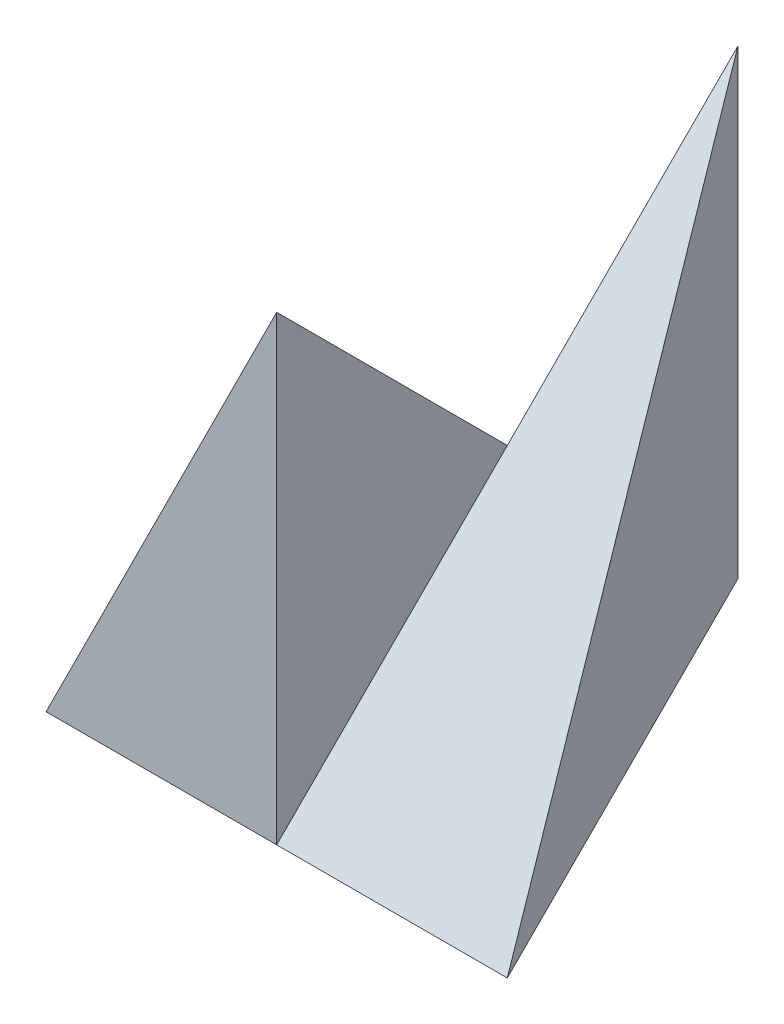
ISO-10303-21;
HEADER;
FILE_DESCRIPTION(('STEP AP214'),'2;1');
FILE_NAME('part.step','',(''),(''),'','','');
FILE_SCHEMA(('AUTOMOTIVE_DESIGN { 1 0 10303 214 1 1 1 1 }'));
ENDSEC;
DATA;
#1=APPLICATION_CONTEXT('core data for automotive mechanical design processes');
#2=APPLICATION_PROTOCOL_DEFINITION('international standard','automotive_design',2000,#1);
#3=PRODUCT_CONTEXT('',#1,'mechanical');
#4=PRODUCT('Part','Part','',(#3));
#5=PRODUCT_RELATED_PRODUCT_CATEGORY('part','',(#4));
#6=PRODUCT_DEFINITION_FORMATION('','',#4);
#7=PRODUCT_DEFINITION_CONTEXT('part definition',#1,'design');
#8=PRODUCT_DEFINITION('design','',#6,#7);
#9=PRODUCT_DEFINITION_SHAPE('','',#8);
#10=(LENGTH_UNIT() NAMED_UNIT(*) SI_UNIT(.MILLI.,.METRE.));
#11=(NAMED_UNIT(*) PLANE_ANGLE_UNIT() SI_UNIT($,.RADIAN.));
#12=(NAMED_UNIT(*) SI_UNIT($,.STERADIAN.) SOLID_ANGLE_UNIT());
#13=UNCERTAINTY_MEASURE_WITH_UNIT(LENGTH_MEASURE(1.E-05),#10,'distance_accuracy_value','');
#14=(GEOMETRIC_REPRESENTATION_CONTEXT(3) GLOBAL_UNCERTAINTY_ASSIGNED_CONTEXT((#13)) GLOBAL_UNIT_ASSIGNED_CONTEXT((#10,
#11,#12)) REPRESENTATION_CONTEXT('',''));
#15=CARTESIAN_POINT('',(0.,0.,0.));
#16=DIRECTION('',(0.,0.,1.));
#17=DIRECTION('',(1.,0.,0.));
#18=AXIS2_PLACEMENT_3D('',#15,#16,#17);
#19=CARTESIAN_POINT('',(-2.,4.,2.));
#20=DIRECTION('',(0.,0.,-1.));
#21=DIRECTION('',(-1.,0.,0.));
#22=AXIS2_PLACEMENT_3D('',#19,#20,#21);
#23=PLANE('',#22);
#24=DIRECTION('',(0.,-1.,0.));
#25=VECTOR('',#24,1.);
#26=CARTESIAN_POINT('',(0.,4.,2.));
#27=LINE('',#26,#25);
#28=CARTESIAN_POINT('',(0.,4.,2.));
#29=VERTEX_POINT('',#28);
#30=CARTESIAN_POINT('',(0.,0.,2.));
#31=VERTEX_POINT('',#30);
#32=EDGE_CURVE('E149',#29,#31,#27,.T.);
#33=ORIENTED_EDGE('',*,*,#32,.F.);
#34=DIRECTION('',(0.447213595499958,0.894427190999916,0.));
#35=VECTOR('',#34,1.);
#36=CARTESIAN_POINT('',(-1.6,0.8,2.));
#37=LINE('',#36,#35);
#38=CARTESIAN_POINT('',(-2.,0.,2.));
#39=VERTEX_POINT('',#38);
#40=EDGE_CURVE('E151',#39,#29,#37,.T.);
#41=ORIENTED_EDGE('',*,*,#40,.F.);
#42=DIRECTION('',(1.,0.,0.));
#43=VECTOR('',#42,1.);
#44=CARTESIAN_POINT('',(-2.,0.,2.));
#45=LINE('',#44,#43);
#46=EDGE_CURVE('E78',#39,#31,#45,.T.);
#47=ORIENTED_EDGE('',*,*,#46,.T.);
#48=EDGE_LOOP('',(#33,#41,#47));
#49=FACE_BOUND('',#48,.T.);
#50=ADVANCED_FACE('F71',(#49),#23,.F.);
#51=CARTESIAN_POINT('',(0.,0.,0.));
#52=DIRECTION('',(0.,-1.,0.));
#53=DIRECTION('',(0.,0.,-1.));
#54=AXIS2_PLACEMENT_3D('',#51,#52,#53);
#55=PLANE('',#54);
#56=DIRECTION('',(-0.447213595499958,0.,0.894427190999916));
#57=VECTOR('',#56,1.);
#58=CARTESIAN_POINT('',(-0.800000000000001,0.,-0.4));
#59=LINE('',#58,#57);
#60=CARTESIAN_POINT('',(0.,0.,-2.));
#61=VERTEX_POINT('',#60);
#62=EDGE_CURVE('E112',#61,#39,#59,.T.);
#63=ORIENTED_EDGE('',*,*,#62,.F.);
#64=DIRECTION('',(-0.447213595499958,0.,-0.894427190999916));
#65=VECTOR('',#64,1.);
#66=CARTESIAN_POINT('',(0.799999999999999,0.,-0.4));
#67=LINE('',#66,#65);
#68=CARTESIAN_POINT('',(2.,0.,2.));
#69=VERTEX_POINT('',#68);
#70=EDGE_CURVE('E118',#69,#61,#67,.T.);
#71=ORIENTED_EDGE('',*,*,#70,.F.);
#72=DIRECTION('',(1.,0.,0.));
#73=VECTOR('',#72,1.);
#74=CARTESIAN_POINT('',(0.,0.,2.));
#75=LINE('',#74,#73);
#76=EDGE_CURVE('E140',#31,#69,#75,.T.);
#77=ORIENTED_EDGE('',*,*,#76,.F.);
#78=ORIENTED_EDGE('',*,*,#46,.F.);
#79=EDGE_LOOP('',(#63,#71,#77,#78));
#80=FACE_BOUND('',#79,.T.);
#81=ADVANCED_FACE('F123',(#80),#55,.T.);
#82=CARTESIAN_POINT('',(0.,4.,2.));
#83=DIRECTION('',(0.,-0.707106781186547,0.707106781186547));
#84=DIRECTION('',(0.,-0.707106781186548,-0.707106781186548));
#85=AXIS2_PLACEMENT_3D('',#82,#83,#84);
#86=PLANE('',#85);
#87=DIRECTION('',(0.,0.707106781186548,0.707106781186548));
#88=VECTOR('',#87,1.);
#89=CARTESIAN_POINT('',(0.,4.,2.));
#90=LINE('',#89,#88);
#91=CARTESIAN_POINT('',(0.,2.,0.));
#92=VERTEX_POINT('',#91);
#93=EDGE_CURVE('E133',#61,#92,#90,.T.);
#94=ORIENTED_EDGE('',*,*,#93,.F.);
#95=DIRECTION('',(-0.333333333333333,0.666666666666667,0.666666666666667));
#96=VECTOR('',#95,1.);
#97=CARTESIAN_POINT('',(-1.77777777777778,3.55555555555556,1.55555555555556));
#98=LINE('',#97,#96);
#99=CARTESIAN_POINT('',(-1.,2.,0.));
#100=VERTEX_POINT('',#99);
#101=EDGE_CURVE('E109',#61,#100,#98,.T.);
#102=ORIENTED_EDGE('',*,*,#101,.T.);
#103=DIRECTION('',(0.333333333333333,0.666666666666667,0.666666666666667));
#104=VECTOR('',#103,1.);
#105=CARTESIAN_POINT('',(0.,4.,2.));
#106=LINE('',#105,#104);
#107=EDGE_CURVE('E153',#100,#29,#106,.T.);
#108=ORIENTED_EDGE('',*,*,#107,.T.);
#109=EDGE_CURVE('E136',#92,#29,#90,.T.);
#110=ORIENTED_EDGE('',*,*,#109,.F.);
#111=EDGE_LOOP('',(#94,#102,#108,#110));
#112=FACE_BOUND('',#111,.T.);
#113=ADVANCED_FACE('F134',(#112),#86,.F.);
#114=CARTESIAN_POINT('',(0.,0.,0.));
#115=DIRECTION('',(-1.,0.,0.));
#116=DIRECTION('',(0.,0.,1.));
#117=AXIS2_PLACEMENT_3D('',#114,#115,#116);
#118=PLANE('',#117);
#119=DIRECTION('',(0.,-0.707106781186548,0.707106781186548));
#120=VECTOR('',#119,1.);
#121=CARTESIAN_POINT('',(0.,1.,1.));
#122=LINE('',#121,#120);
#123=CARTESIAN_POINT('',(0.,4.,-2.));
#124=VERTEX_POINT('',#123);
#125=EDGE_CURVE('E12',#124,#92,#122,.T.);
#126=ORIENTED_EDGE('',*,*,#125,.F.);
#127=DIRECTION('',(0.,-1.,0.));
#128=VECTOR('',#127,1.);
#129=CARTESIAN_POINT('',(0.,0.,-2.));
#130=LINE('',#129,#128);
#131=EDGE_CURVE('E85',#124,#61,#130,.T.);
#132=ORIENTED_EDGE('',*,*,#131,.T.);
#133=ORIENTED_EDGE('',*,*,#93,.T.);
#134=EDGE_LOOP('',(#126,#132,#133));
#135=FACE_BOUND('',#134,.T.);
#136=ADVANCED_FACE('F139',(#135),#118,.T.);
#137=CARTESIAN_POINT('',(0.,0.,0.));
#138=DIRECTION('',(-1.,0.,0.));
#139=DIRECTION('',(0.,0.,1.));
#140=AXIS2_PLACEMENT_3D('',#137,#138,#139);
#141=PLANE('',#140);
#142=ORIENTED_EDGE('',*,*,#32,.T.);
#143=DIRECTION('',(0.,0.707106781186548,-0.707106781186548));
#144=VECTOR('',#143,1.);
#145=CARTESIAN_POINT('',(0.,0.,2.));
#146=LINE('',#145,#144);
#147=EDGE_CURVE('E142',#31,#92,#146,.T.);
#148=ORIENTED_EDGE('',*,*,#147,.T.);
#149=ORIENTED_EDGE('',*,*,#109,.T.);
#150=EDGE_LOOP('',(#142,#148,#149));
#151=FACE_BOUND('',#150,.T.);
#152=ADVANCED_FACE('F159',(#151),#141,.F.);
#153=CARTESIAN_POINT('',(0.,0.,2.));
#154=DIRECTION('',(0.,-0.707106781186547,-0.707106781186547));
#155=DIRECTION('',(0.,0.707106781186548,-0.707106781186548));
#156=AXIS2_PLACEMENT_3D('',#153,#154,#155);
#157=PLANE('',#156);
#158=ORIENTED_EDGE('',*,*,#76,.T.);
#159=DIRECTION('',(-0.333333333333333,0.666666666666667,-0.666666666666667));
#160=VECTOR('',#159,1.);
#161=CARTESIAN_POINT('',(1.77777777777778,0.444444444444444,1.55555555555556));
#162=LINE('',#161,#160);
#163=EDGE_CURVE('E129',#69,#124,#162,.T.);
#164=ORIENTED_EDGE('',*,*,#163,.T.);
#165=ORIENTED_EDGE('',*,*,#125,.T.);
#166=ORIENTED_EDGE('',*,*,#147,.F.);
#167=EDGE_LOOP('',(#158,#164,#165,#166));
#168=FACE_BOUND('',#167,.T.);
#169=ADVANCED_FACE('F160',(#168),#157,.F.);
#170=CARTESIAN_POINT('',(-1.6,0.8,-8.));
#171=DIRECTION('',(0.894427190999916,-0.447213595499958,0.));
#172=DIRECTION('',(0.447213595499958,0.894427190999916,0.));
#173=AXIS2_PLACEMENT_3D('',#170,#171,#172);
#174=PLANE('',#173);
#175=ORIENTED_EDGE('',*,*,#107,.F.);
#176=DIRECTION('',(-0.333333333333333,-0.666666666666667,0.666666666666667));
#177=VECTOR('',#176,1.);
#178=CARTESIAN_POINT('',(0.444444444444444,4.88888888888889,-2.88888888888889));
#179=LINE('',#178,#177);
#180=EDGE_CURVE('E114',#100,#39,#179,.T.);
#181=ORIENTED_EDGE('',*,*,#180,.T.);
#182=ORIENTED_EDGE('',*,*,#40,.T.);
#183=EDGE_LOOP('',(#175,#181,#182));
#184=FACE_BOUND('',#183,.T.);
#185=ADVANCED_FACE('F162',(#184),#174,.F.);
#186=CARTESIAN_POINT('',(0.799999999999999,10.,-0.4));
#187=DIRECTION('',(-0.894427190999916,0.,0.447213595499958));
#188=DIRECTION('',(0.447213595499958,0.,0.894427190999916));
#189=AXIS2_PLACEMENT_3D('',#186,#187,#188);
#190=PLANE('',#189);
#191=ORIENTED_EDGE('',*,*,#70,.T.);
#192=ORIENTED_EDGE('',*,*,#131,.F.);
#193=ORIENTED_EDGE('',*,*,#163,.F.);
#194=EDGE_LOOP('',(#191,#192,#193));
#195=FACE_BOUND('',#194,.T.);
#196=ADVANCED_FACE('F128',(#195),#190,.F.);
#197=CARTESIAN_POINT('',(-0.800000000000001,10.,-0.4));
#198=DIRECTION('',(0.894427190999916,0.,0.447213595499958));
#199=DIRECTION('',(0.447213595499958,0.,-0.894427190999916));
#200=AXIS2_PLACEMENT_3D('',#197,#198,#199);
#201=PLANE('',#200);
#202=ORIENTED_EDGE('',*,*,#62,.T.);
#203=ORIENTED_EDGE('',*,*,#180,.F.);
#204=ORIENTED_EDGE('',*,*,#101,.F.);
#205=EDGE_LOOP('',(#202,#203,#204));
#206=FACE_BOUND('',#205,.T.);
#207=ADVANCED_FACE('F111',(#206),#201,.F.);
#208=CLOSED_SHELL('',(#50,#81,#113,#136,#152,#169,#185,#196,#207));
#209=MANIFOLD_SOLID_BREP('B2',#208);
#210=ADVANCED_BREP_SHAPE_REPRESENTATION('',(#18,#209),#14);
#211=SHAPE_DEFINITION_REPRESENTATION(#9,#210);
ENDSEC;
END-ISO-10303-21;
